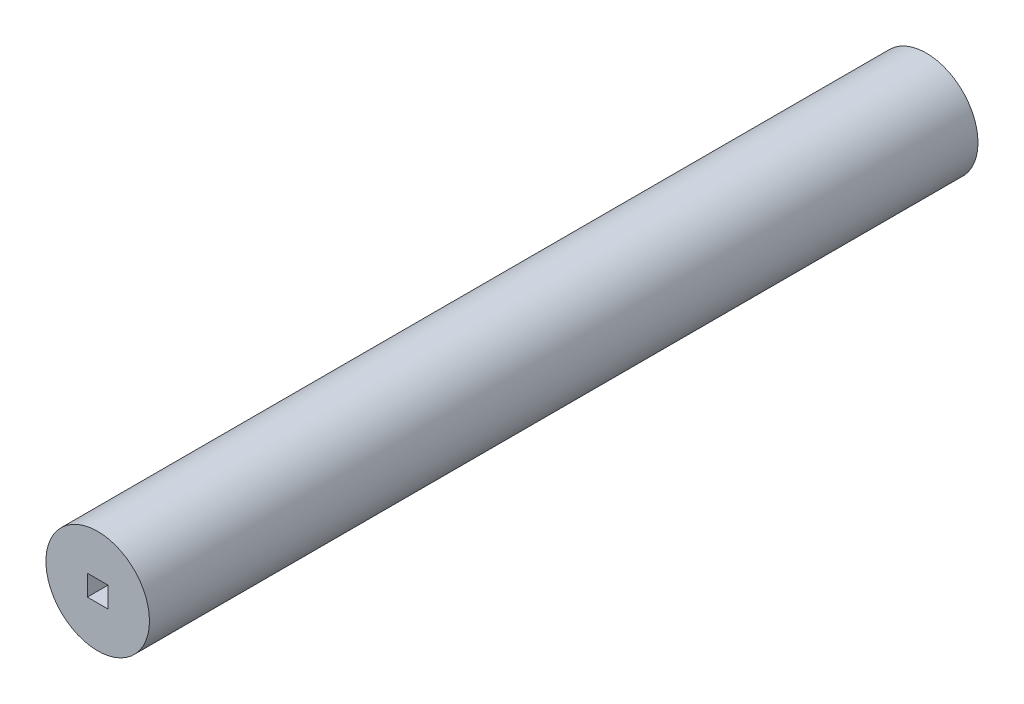
ISO-10303-21;
HEADER;
FILE_DESCRIPTION(('STEP AP214'),'2;1');
FILE_NAME('part.step','',(''),(''),'','','');
FILE_SCHEMA(('AUTOMOTIVE_DESIGN { 1 0 10303 214 1 1 1 1 }'));
ENDSEC;
DATA;
#1=APPLICATION_CONTEXT('core data for automotive mechanical design processes');
#2=APPLICATION_PROTOCOL_DEFINITION('international standard','automotive_design',2000,#1);
#3=PRODUCT_CONTEXT('',#1,'mechanical');
#4=PRODUCT('Part','Part','',(#3));
#5=PRODUCT_RELATED_PRODUCT_CATEGORY('part','',(#4));
#6=PRODUCT_DEFINITION_FORMATION('','',#4);
#7=PRODUCT_DEFINITION_CONTEXT('part definition',#1,'design');
#8=PRODUCT_DEFINITION('design','',#6,#7);
#9=PRODUCT_DEFINITION_SHAPE('','',#8);
#10=(LENGTH_UNIT() NAMED_UNIT(*) SI_UNIT(.MILLI.,.METRE.));
#11=(NAMED_UNIT(*) PLANE_ANGLE_UNIT() SI_UNIT($,.RADIAN.));
#12=(NAMED_UNIT(*) SI_UNIT($,.STERADIAN.) SOLID_ANGLE_UNIT());
#13=UNCERTAINTY_MEASURE_WITH_UNIT(LENGTH_MEASURE(1.E-05),#10,'distance_accuracy_value','');
#14=(GEOMETRIC_REPRESENTATION_CONTEXT(3) GLOBAL_UNCERTAINTY_ASSIGNED_CONTEXT((#13)) GLOBAL_UNIT_ASSIGNED_CONTEXT((#10,
#11,#12)) REPRESENTATION_CONTEXT('',''));
#15=CARTESIAN_POINT('',(0.,0.,0.));
#16=DIRECTION('',(0.,0.,1.));
#17=DIRECTION('',(1.,0.,0.));
#18=AXIS2_PLACEMENT_3D('',#15,#16,#17);
#19=CARTESIAN_POINT('',(0.,0.,127.));
#20=DIRECTION('',(0.,0.,-1.));
#21=DIRECTION('',(-1.,0.,0.));
#22=AXIS2_PLACEMENT_3D('',#19,#20,#21);
#23=CYLINDRICAL_SURFACE('',#22,7.9375);
#24=CARTESIAN_POINT('',(0.,0.,127.));
#25=DIRECTION('',(0.,0.,1.));
#26=DIRECTION('',(1.,0.,0.));
#27=AXIS2_PLACEMENT_3D('',#24,#25,#26);
#28=CIRCLE('',#27,7.9375);
#29=CARTESIAN_POINT('',(7.9375,0.,127.));
#30=VERTEX_POINT('',#29);
#31=EDGE_CURVE('E11',#30,#30,#28,.T.);
#32=ORIENTED_EDGE('',*,*,#31,.F.);
#33=EDGE_LOOP('',(#32));
#34=FACE_BOUND('',#33,.T.);
#35=CARTESIAN_POINT('',(0.,0.,0.));
#36=DIRECTION('',(0.,0.,1.));
#37=DIRECTION('',(1.,0.,0.));
#38=AXIS2_PLACEMENT_3D('',#35,#36,#37);
#39=CIRCLE('',#38,7.9375);
#40=CARTESIAN_POINT('',(7.9375,0.,0.));
#41=VERTEX_POINT('',#40);
#42=EDGE_CURVE('E36',#41,#41,#39,.T.);
#43=ORIENTED_EDGE('',*,*,#42,.T.);
#44=EDGE_LOOP('',(#43));
#45=FACE_BOUND('',#44,.T.);
#46=ADVANCED_FACE('F33',(#34,#45),#23,.T.);
#47=CARTESIAN_POINT('',(0.,0.,127.));
#48=DIRECTION('',(0.,0.,1.));
#49=DIRECTION('',(1.,0.,0.));
#50=AXIS2_PLACEMENT_3D('',#47,#48,#49);
#51=PLANE('',#50);
#52=DIRECTION('',(-1.,0.,0.));
#53=VECTOR('',#52,1.);
#54=CARTESIAN_POINT('',(0.,1.5875,127.));
#55=LINE('',#54,#53);
#56=CARTESIAN_POINT('',(1.5875,1.5875,127.));
#57=VERTEX_POINT('',#56);
#58=CARTESIAN_POINT('',(-1.5875,1.5875,127.));
#59=VERTEX_POINT('',#58);
#60=EDGE_CURVE('E77',#57,#59,#55,.T.);
#61=ORIENTED_EDGE('',*,*,#60,.F.);
#62=DIRECTION('',(0.,1.,0.));
#63=VECTOR('',#62,1.);
#64=CARTESIAN_POINT('',(1.5875,1.5875,127.));
#65=LINE('',#64,#63);
#66=CARTESIAN_POINT('',(1.5875,-1.5875,127.));
#67=VERTEX_POINT('',#66);
#68=EDGE_CURVE('E92',#67,#57,#65,.T.);
#69=ORIENTED_EDGE('',*,*,#68,.F.);
#70=DIRECTION('',(1.,0.,0.));
#71=VECTOR('',#70,1.);
#72=CARTESIAN_POINT('',(1.5875,-1.5875,127.));
#73=LINE('',#72,#71);
#74=CARTESIAN_POINT('',(-1.5875,-1.5875,127.));
#75=VERTEX_POINT('',#74);
#76=EDGE_CURVE('E99',#75,#67,#73,.T.);
#77=ORIENTED_EDGE('',*,*,#76,.F.);
#78=DIRECTION('',(0.,-1.,0.));
#79=VECTOR('',#78,1.);
#80=CARTESIAN_POINT('',(-1.5875,-1.5875,127.));
#81=LINE('',#80,#79);
#82=EDGE_CURVE('E97',#59,#75,#81,.T.);
#83=ORIENTED_EDGE('',*,*,#82,.F.);
#84=EDGE_LOOP('',(#61,#69,#77,#83));
#85=FACE_BOUND('',#84,.T.);
#86=ORIENTED_EDGE('',*,*,#31,.T.);
#87=EDGE_LOOP('',(#86));
#88=FACE_BOUND('',#87,.T.);
#89=ADVANCED_FACE('F112',(#85,#88),#51,.T.);
#90=CARTESIAN_POINT('',(0.,0.,0.));
#91=DIRECTION('',(0.,0.,1.));
#92=DIRECTION('',(1.,0.,0.));
#93=AXIS2_PLACEMENT_3D('',#90,#91,#92);
#94=PLANE('',#93);
#95=DIRECTION('',(0.,1.,0.));
#96=VECTOR('',#95,1.);
#97=CARTESIAN_POINT('',(1.5875,1.5875,0.));
#98=LINE('',#97,#96);
#99=CARTESIAN_POINT('',(1.5875,-1.5875,0.));
#100=VERTEX_POINT('',#99);
#101=CARTESIAN_POINT('',(1.5875,1.5875,0.));
#102=VERTEX_POINT('',#101);
#103=EDGE_CURVE('E80',#100,#102,#98,.T.);
#104=ORIENTED_EDGE('',*,*,#103,.T.);
#105=DIRECTION('',(-1.,0.,0.));
#106=VECTOR('',#105,1.);
#107=CARTESIAN_POINT('',(-1.5875,1.5875,0.));
#108=LINE('',#107,#106);
#109=CARTESIAN_POINT('',(-1.5875,1.5875,0.));
#110=VERTEX_POINT('',#109);
#111=EDGE_CURVE('E74',#102,#110,#108,.T.);
#112=ORIENTED_EDGE('',*,*,#111,.T.);
#113=DIRECTION('',(0.,-1.,0.));
#114=VECTOR('',#113,1.);
#115=CARTESIAN_POINT('',(-1.5875,-1.5875,0.));
#116=LINE('',#115,#114);
#117=CARTESIAN_POINT('',(-1.5875,-1.5875,0.));
#118=VERTEX_POINT('',#117);
#119=EDGE_CURVE('E83',#110,#118,#116,.T.);
#120=ORIENTED_EDGE('',*,*,#119,.T.);
#121=DIRECTION('',(1.,0.,0.));
#122=VECTOR('',#121,1.);
#123=CARTESIAN_POINT('',(1.5875,-1.5875,0.));
#124=LINE('',#123,#122);
#125=EDGE_CURVE('E55',#118,#100,#124,.T.);
#126=ORIENTED_EDGE('',*,*,#125,.T.);
#127=EDGE_LOOP('',(#104,#112,#120,#126));
#128=FACE_BOUND('',#127,.T.);
#129=ORIENTED_EDGE('',*,*,#42,.F.);
#130=EDGE_LOOP('',(#129));
#131=FACE_BOUND('',#130,.T.);
#132=ADVANCED_FACE('F88',(#128,#131),#94,.F.);
#133=CARTESIAN_POINT('',(0.,1.5875,0.));
#134=DIRECTION('',(0.,1.,0.));
#135=DIRECTION('',(0.,0.,1.));
#136=AXIS2_PLACEMENT_3D('',#133,#134,#135);
#137=PLANE('',#136);
#138=ORIENTED_EDGE('',*,*,#60,.T.);
#139=DIRECTION('',(0.,0.,1.));
#140=VECTOR('',#139,1.);
#141=CARTESIAN_POINT('',(-1.5875,1.5875,0.));
#142=LINE('',#141,#140);
#143=EDGE_CURVE('E47',#110,#59,#142,.T.);
#144=ORIENTED_EDGE('',*,*,#143,.F.);
#145=ORIENTED_EDGE('',*,*,#111,.F.);
#146=DIRECTION('',(0.,0.,1.));
#147=VECTOR('',#146,1.);
#148=CARTESIAN_POINT('',(1.5875,1.5875,0.));
#149=LINE('',#148,#147);
#150=EDGE_CURVE('E104',#102,#57,#149,.T.);
#151=ORIENTED_EDGE('',*,*,#150,.T.);
#152=EDGE_LOOP('',(#138,#144,#145,#151));
#153=FACE_BOUND('',#152,.T.);
#154=ADVANCED_FACE('F72',(#153),#137,.F.);
#155=CARTESIAN_POINT('',(1.5875,1.5875,0.));
#156=DIRECTION('',(1.,0.,0.));
#157=DIRECTION('',(0.,1.,0.));
#158=AXIS2_PLACEMENT_3D('',#155,#156,#157);
#159=PLANE('',#158);
#160=ORIENTED_EDGE('',*,*,#68,.T.);
#161=ORIENTED_EDGE('',*,*,#150,.F.);
#162=ORIENTED_EDGE('',*,*,#103,.F.);
#163=DIRECTION('',(0.,0.,1.));
#164=VECTOR('',#163,1.);
#165=CARTESIAN_POINT('',(1.5875,-1.5875,0.));
#166=LINE('',#165,#164);
#167=EDGE_CURVE('E106',#100,#67,#166,.T.);
#168=ORIENTED_EDGE('',*,*,#167,.T.);
#169=EDGE_LOOP('',(#160,#161,#162,#168));
#170=FACE_BOUND('',#169,.T.);
#171=ADVANCED_FACE('F115',(#170),#159,.F.);
#172=CARTESIAN_POINT('',(1.5875,-1.5875,0.));
#173=DIRECTION('',(0.,-1.,0.));
#174=DIRECTION('',(1.,0.,0.));
#175=AXIS2_PLACEMENT_3D('',#172,#173,#174);
#176=PLANE('',#175);
#177=ORIENTED_EDGE('',*,*,#76,.T.);
#178=ORIENTED_EDGE('',*,*,#167,.F.);
#179=ORIENTED_EDGE('',*,*,#125,.F.);
#180=DIRECTION('',(0.,0.,1.));
#181=VECTOR('',#180,1.);
#182=CARTESIAN_POINT('',(-1.5875,-1.5875,0.));
#183=LINE('',#182,#181);
#184=EDGE_CURVE('E79',#118,#75,#183,.T.);
#185=ORIENTED_EDGE('',*,*,#184,.T.);
#186=EDGE_LOOP('',(#177,#178,#179,#185));
#187=FACE_BOUND('',#186,.T.);
#188=ADVANCED_FACE('F108',(#187),#176,.F.);
#189=CARTESIAN_POINT('',(-1.5875,-1.5875,0.));
#190=DIRECTION('',(-1.,0.,0.));
#191=DIRECTION('',(0.,0.,1.));
#192=AXIS2_PLACEMENT_3D('',#189,#190,#191);
#193=PLANE('',#192);
#194=ORIENTED_EDGE('',*,*,#82,.T.);
#195=ORIENTED_EDGE('',*,*,#184,.F.);
#196=ORIENTED_EDGE('',*,*,#119,.F.);
#197=ORIENTED_EDGE('',*,*,#143,.T.);
#198=EDGE_LOOP('',(#194,#195,#196,#197));
#199=FACE_BOUND('',#198,.T.);
#200=ADVANCED_FACE('F84',(#199),#193,.F.);
#201=CLOSED_SHELL('',(#46,#89,#132,#154,#171,#188,#200));
#202=MANIFOLD_SOLID_BREP('B2',#201);
#203=ADVANCED_BREP_SHAPE_REPRESENTATION('',(#18,#202),#14);
#204=SHAPE_DEFINITION_REPRESENTATION(#9,#203);
ENDSEC;
END-ISO-10303-21;
